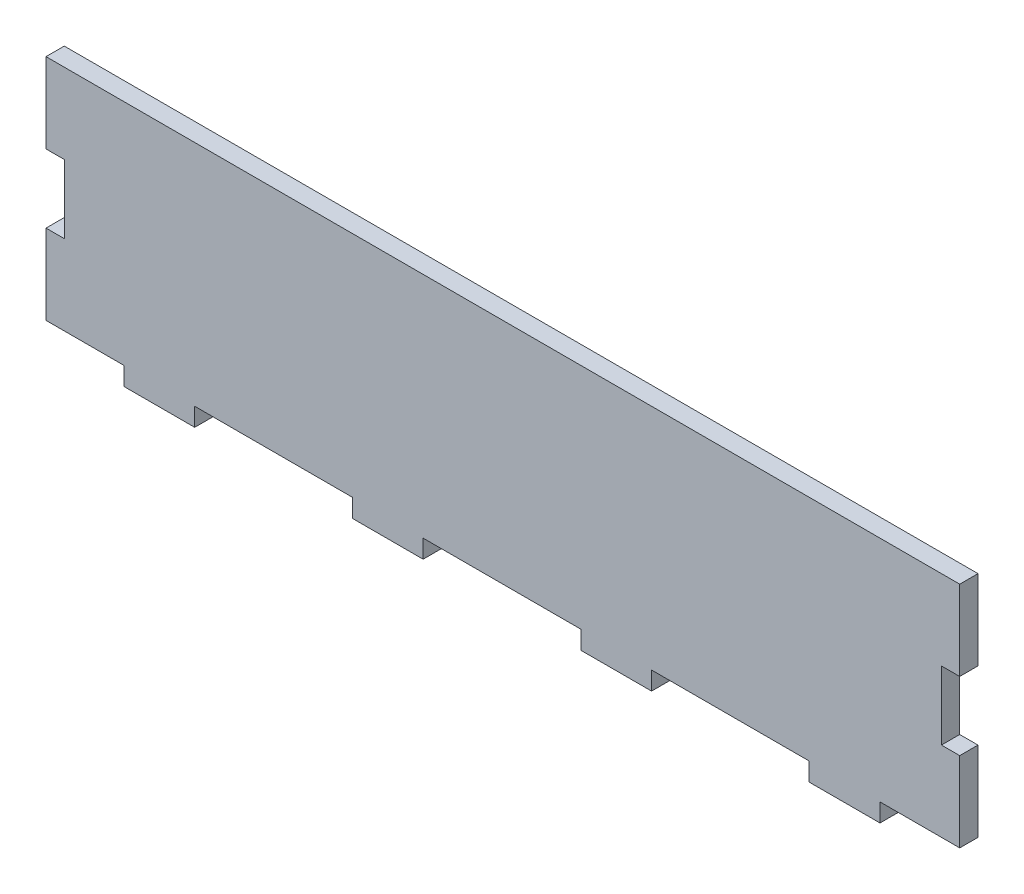
ISO-10303-21;
HEADER;
FILE_DESCRIPTION(('STEP AP214'),'2;1');
FILE_NAME('part.step','',(''),(''),'','','');
FILE_SCHEMA(('AUTOMOTIVE_DESIGN { 1 0 10303 214 1 1 1 1 }'));
ENDSEC;
DATA;
#1=APPLICATION_CONTEXT('core data for automotive mechanical design processes');
#2=APPLICATION_PROTOCOL_DEFINITION('international standard','automotive_design',2000,#1);
#3=PRODUCT_CONTEXT('',#1,'mechanical');
#4=PRODUCT('Part','Part','',(#3));
#5=PRODUCT_RELATED_PRODUCT_CATEGORY('part','',(#4));
#6=PRODUCT_DEFINITION_FORMATION('','',#4);
#7=PRODUCT_DEFINITION_CONTEXT('part definition',#1,'design');
#8=PRODUCT_DEFINITION('design','',#6,#7);
#9=PRODUCT_DEFINITION_SHAPE('','',#8);
#10=(LENGTH_UNIT() NAMED_UNIT(*) SI_UNIT(.MILLI.,.METRE.));
#11=(NAMED_UNIT(*) PLANE_ANGLE_UNIT() SI_UNIT($,.RADIAN.));
#12=(NAMED_UNIT(*) SI_UNIT($,.STERADIAN.) SOLID_ANGLE_UNIT());
#13=UNCERTAINTY_MEASURE_WITH_UNIT(LENGTH_MEASURE(1.E-05),#10,'distance_accuracy_value','');
#14=(GEOMETRIC_REPRESENTATION_CONTEXT(3) GLOBAL_UNCERTAINTY_ASSIGNED_CONTEXT((#13)) GLOBAL_UNIT_ASSIGNED_CONTEXT((#10,
#11,#12)) REPRESENTATION_CONTEXT('',''));
#15=CARTESIAN_POINT('',(0.,0.,0.));
#16=DIRECTION('',(0.,0.,1.));
#17=DIRECTION('',(1.,0.,0.));
#18=AXIS2_PLACEMENT_3D('',#15,#16,#17);
#19=CARTESIAN_POINT('',(0.,0.,4.));
#20=DIRECTION('',(1.,0.,0.));
#21=DIRECTION('',(0.,0.,-1.));
#22=AXIS2_PLACEMENT_3D('',#19,#20,#21);
#23=PLANE('',#22);
#24=DIRECTION('',(0.,-1.,0.));
#25=VECTOR('',#24,1.);
#26=CARTESIAN_POINT('',(0.,0.,0.));
#27=LINE('',#26,#25);
#28=CARTESIAN_POINT('',(0.,50.,0.));
#29=VERTEX_POINT('',#28);
#30=CARTESIAN_POINT('',(0.,32.5,0.));
#31=VERTEX_POINT('',#30);
#32=EDGE_CURVE('E236',#29,#31,#27,.T.);
#33=ORIENTED_EDGE('',*,*,#32,.T.);
#34=DIRECTION('',(0.,0.,1.));
#35=VECTOR('',#34,1.);
#36=CARTESIAN_POINT('',(0.,32.5,-0.00100000000000013));
#37=LINE('',#36,#35);
#38=CARTESIAN_POINT('',(0.,32.5,4.));
#39=VERTEX_POINT('',#38);
#40=EDGE_CURVE('E217',#31,#39,#37,.T.);
#41=ORIENTED_EDGE('',*,*,#40,.T.);
#42=DIRECTION('',(0.,-1.,0.));
#43=VECTOR('',#42,1.);
#44=CARTESIAN_POINT('',(0.,0.,4.));
#45=LINE('',#44,#43);
#46=CARTESIAN_POINT('',(0.,50.,4.));
#47=VERTEX_POINT('',#46);
#48=EDGE_CURVE('E414',#47,#39,#45,.T.);
#49=ORIENTED_EDGE('',*,*,#48,.F.);
#50=DIRECTION('',(0.,0.,-1.));
#51=VECTOR('',#50,1.);
#52=CARTESIAN_POINT('',(0.,50.,4.));
#53=LINE('',#52,#51);
#54=EDGE_CURVE('E243',#47,#29,#53,.T.);
#55=ORIENTED_EDGE('',*,*,#54,.T.);
#56=EDGE_LOOP('',(#33,#41,#49,#55));
#57=FACE_BOUND('',#56,.T.);
#58=ADVANCED_FACE('F33',(#57),#23,.F.);
#59=CARTESIAN_POINT('',(200.,0.,4.));
#60=DIRECTION('',(-1.,0.,0.));
#61=DIRECTION('',(0.,0.,1.));
#62=AXIS2_PLACEMENT_3D('',#59,#60,#61);
#63=PLANE('',#62);
#64=DIRECTION('',(0.,1.,0.));
#65=VECTOR('',#64,1.);
#66=CARTESIAN_POINT('',(200.,0.,4.));
#67=LINE('',#66,#65);
#68=CARTESIAN_POINT('',(200.,32.5,4.));
#69=VERTEX_POINT('',#68);
#70=CARTESIAN_POINT('',(200.,50.,4.));
#71=VERTEX_POINT('',#70);
#72=EDGE_CURVE('E419',#69,#71,#67,.T.);
#73=ORIENTED_EDGE('',*,*,#72,.F.);
#74=DIRECTION('',(0.,0.,1.));
#75=VECTOR('',#74,1.);
#76=CARTESIAN_POINT('',(200.,32.5,-0.00100000000000013));
#77=LINE('',#76,#75);
#78=CARTESIAN_POINT('',(200.,32.5,0.));
#79=VERTEX_POINT('',#78);
#80=EDGE_CURVE('E299',#79,#69,#77,.T.);
#81=ORIENTED_EDGE('',*,*,#80,.F.);
#82=DIRECTION('',(0.,1.,0.));
#83=VECTOR('',#82,1.);
#84=CARTESIAN_POINT('',(200.,0.,0.));
#85=LINE('',#84,#83);
#86=CARTESIAN_POINT('',(200.,50.,0.));
#87=VERTEX_POINT('',#86);
#88=EDGE_CURVE('E255',#79,#87,#85,.T.);
#89=ORIENTED_EDGE('',*,*,#88,.T.);
#90=DIRECTION('',(0.,0.,-1.));
#91=VECTOR('',#90,1.);
#92=CARTESIAN_POINT('',(200.,50.,4.));
#93=LINE('',#92,#91);
#94=EDGE_CURVE('E264',#71,#87,#93,.T.);
#95=ORIENTED_EDGE('',*,*,#94,.F.);
#96=EDGE_LOOP('',(#73,#81,#89,#95));
#97=FACE_BOUND('',#96,.T.);
#98=ADVANCED_FACE('F431',(#97),#63,.F.);
#99=CARTESIAN_POINT('',(0.,0.,4.));
#100=DIRECTION('',(0.,1.,0.));
#101=DIRECTION('',(0.,0.,1.));
#102=AXIS2_PLACEMENT_3D('',#99,#100,#101);
#103=PLANE('',#102);
#104=DIRECTION('',(0.,0.,1.));
#105=VECTOR('',#104,1.);
#106=CARTESIAN_POINT('',(32.55,0.,0.));
#107=LINE('',#106,#105);
#108=CARTESIAN_POINT('',(32.55,0.,0.));
#109=VERTEX_POINT('',#108);
#110=CARTESIAN_POINT('',(32.55,0.,4.));
#111=VERTEX_POINT('',#110);
#112=EDGE_CURVE('E315',#109,#111,#107,.T.);
#113=ORIENTED_EDGE('',*,*,#112,.F.);
#114=DIRECTION('',(1.,0.,0.));
#115=VECTOR('',#114,1.);
#116=CARTESIAN_POINT('',(0.,0.,0.));
#117=LINE('',#116,#115);
#118=CARTESIAN_POINT('',(67.05,0.,0.));
#119=VERTEX_POINT('',#118);
#120=EDGE_CURVE('E256',#109,#119,#117,.T.);
#121=ORIENTED_EDGE('',*,*,#120,.T.);
#122=DIRECTION('',(0.,0.,1.));
#123=VECTOR('',#122,1.);
#124=CARTESIAN_POINT('',(67.05,0.,0.));
#125=LINE('',#124,#123);
#126=CARTESIAN_POINT('',(67.05,0.,4.));
#127=VERTEX_POINT('',#126);
#128=EDGE_CURVE('E352',#119,#127,#125,.T.);
#129=ORIENTED_EDGE('',*,*,#128,.T.);
#130=DIRECTION('',(1.,0.,0.));
#131=VECTOR('',#130,1.);
#132=CARTESIAN_POINT('',(0.,0.,4.));
#133=LINE('',#132,#131);
#134=EDGE_CURVE('E420',#111,#127,#133,.T.);
#135=ORIENTED_EDGE('',*,*,#134,.F.);
#136=EDGE_LOOP('',(#113,#121,#129,#135));
#137=FACE_BOUND('',#136,.T.);
#138=ADVANCED_FACE('F474',(#137),#103,.F.);
#139=DIRECTION('',(0.,0.,1.));
#140=VECTOR('',#139,1.);
#141=CARTESIAN_POINT('',(17.05,0.,0.));
#142=LINE('',#141,#140);
#143=CARTESIAN_POINT('',(17.05,0.,0.));
#144=VERTEX_POINT('',#143);
#145=CARTESIAN_POINT('',(17.05,0.,4.));
#146=VERTEX_POINT('',#145);
#147=EDGE_CURVE('E325',#144,#146,#142,.T.);
#148=ORIENTED_EDGE('',*,*,#147,.T.);
#149=CARTESIAN_POINT('',(0.,0.,4.));
#150=VERTEX_POINT('',#149);
#151=EDGE_CURVE('E417',#150,#146,#133,.T.);
#152=ORIENTED_EDGE('',*,*,#151,.F.);
#153=DIRECTION('',(0.,0.,-1.));
#154=VECTOR('',#153,1.);
#155=CARTESIAN_POINT('',(0.,0.,4.));
#156=LINE('',#155,#154);
#157=CARTESIAN_POINT('',(0.,0.,0.));
#158=VERTEX_POINT('',#157);
#159=EDGE_CURVE('E11',#150,#158,#156,.T.);
#160=ORIENTED_EDGE('',*,*,#159,.T.);
#161=EDGE_CURVE('E249',#158,#144,#117,.T.);
#162=ORIENTED_EDGE('',*,*,#161,.T.);
#163=EDGE_LOOP('',(#148,#152,#160,#162));
#164=FACE_BOUND('',#163,.T.);
#165=ADVANCED_FACE('F457',(#164),#103,.F.);
#166=DIRECTION('',(0.,0.,1.));
#167=VECTOR('',#166,1.);
#168=CARTESIAN_POINT('',(82.55,0.,0.));
#169=LINE('',#168,#167);
#170=CARTESIAN_POINT('',(82.55,0.,0.));
#171=VERTEX_POINT('',#170);
#172=CARTESIAN_POINT('',(82.55,0.,4.));
#173=VERTEX_POINT('',#172);
#174=EDGE_CURVE('E343',#171,#173,#169,.T.);
#175=ORIENTED_EDGE('',*,*,#174,.F.);
#176=CARTESIAN_POINT('',(117.05,0.,0.));
#177=VERTEX_POINT('',#176);
#178=EDGE_CURVE('E499',#171,#177,#117,.T.);
#179=ORIENTED_EDGE('',*,*,#178,.T.);
#180=DIRECTION('',(0.,0.,1.));
#181=VECTOR('',#180,1.);
#182=CARTESIAN_POINT('',(117.05,0.,0.));
#183=LINE('',#182,#181);
#184=CARTESIAN_POINT('',(117.05,0.,4.));
#185=VERTEX_POINT('',#184);
#186=EDGE_CURVE('E380',#177,#185,#183,.T.);
#187=ORIENTED_EDGE('',*,*,#186,.T.);
#188=EDGE_CURVE('E476',#173,#185,#133,.T.);
#189=ORIENTED_EDGE('',*,*,#188,.F.);
#190=EDGE_LOOP('',(#175,#179,#187,#189));
#191=FACE_BOUND('',#190,.T.);
#192=ADVANCED_FACE('F502',(#191),#103,.F.);
#193=DIRECTION('',(0.,0.,1.));
#194=VECTOR('',#193,1.);
#195=CARTESIAN_POINT('',(132.55,0.,0.));
#196=LINE('',#195,#194);
#197=CARTESIAN_POINT('',(132.55,0.,0.));
#198=VERTEX_POINT('',#197);
#199=CARTESIAN_POINT('',(132.55,0.,4.));
#200=VERTEX_POINT('',#199);
#201=EDGE_CURVE('E371',#198,#200,#196,.T.);
#202=ORIENTED_EDGE('',*,*,#201,.F.);
#203=CARTESIAN_POINT('',(167.05,0.,0.));
#204=VERTEX_POINT('',#203);
#205=EDGE_CURVE('E247',#198,#204,#117,.T.);
#206=ORIENTED_EDGE('',*,*,#205,.T.);
#207=DIRECTION('',(0.,0.,1.));
#208=VECTOR('',#207,1.);
#209=CARTESIAN_POINT('',(167.05,0.,0.));
#210=LINE('',#209,#208);
#211=CARTESIAN_POINT('',(167.05,0.,4.));
#212=VERTEX_POINT('',#211);
#213=EDGE_CURVE('E406',#204,#212,#210,.T.);
#214=ORIENTED_EDGE('',*,*,#213,.T.);
#215=EDGE_CURVE('E477',#200,#212,#133,.T.);
#216=ORIENTED_EDGE('',*,*,#215,.F.);
#217=EDGE_LOOP('',(#202,#206,#214,#216));
#218=FACE_BOUND('',#217,.T.);
#219=ADVANCED_FACE('F497',(#218),#103,.F.);
#220=DIRECTION('',(0.,0.,1.));
#221=VECTOR('',#220,1.);
#222=CARTESIAN_POINT('',(182.55,0.,0.));
#223=LINE('',#222,#221);
#224=CARTESIAN_POINT('',(182.55,0.,0.));
#225=VERTEX_POINT('',#224);
#226=CARTESIAN_POINT('',(182.55,0.,4.));
#227=VERTEX_POINT('',#226);
#228=EDGE_CURVE('E398',#225,#227,#223,.T.);
#229=ORIENTED_EDGE('',*,*,#228,.F.);
#230=CARTESIAN_POINT('',(200.,0.,0.));
#231=VERTEX_POINT('',#230);
#232=EDGE_CURVE('E244',#225,#231,#117,.T.);
#233=ORIENTED_EDGE('',*,*,#232,.T.);
#234=DIRECTION('',(0.,0.,-1.));
#235=VECTOR('',#234,1.);
#236=CARTESIAN_POINT('',(200.,0.,4.));
#237=LINE('',#236,#235);
#238=CARTESIAN_POINT('',(200.,0.,4.));
#239=VERTEX_POINT('',#238);
#240=EDGE_CURVE('E41',#239,#231,#237,.T.);
#241=ORIENTED_EDGE('',*,*,#240,.F.);
#242=EDGE_CURVE('E416',#227,#239,#133,.T.);
#243=ORIENTED_EDGE('',*,*,#242,.F.);
#244=EDGE_LOOP('',(#229,#233,#241,#243));
#245=FACE_BOUND('',#244,.T.);
#246=ADVANCED_FACE('F484',(#245),#103,.F.);
#247=CARTESIAN_POINT('',(0.,17.5,4.));
#248=VERTEX_POINT('',#247);
#249=EDGE_CURVE('E262',#248,#150,#45,.T.);
#250=ORIENTED_EDGE('',*,*,#249,.F.);
#251=DIRECTION('',(0.,0.,1.));
#252=VECTOR('',#251,1.);
#253=CARTESIAN_POINT('',(0.,17.5,-0.00100000000000013));
#254=LINE('',#253,#252);
#255=CARTESIAN_POINT('',(0.,17.5,0.));
#256=VERTEX_POINT('',#255);
#257=EDGE_CURVE('E439',#256,#248,#254,.T.);
#258=ORIENTED_EDGE('',*,*,#257,.F.);
#259=EDGE_CURVE('E245',#256,#158,#27,.T.);
#260=ORIENTED_EDGE('',*,*,#259,.T.);
#261=ORIENTED_EDGE('',*,*,#159,.F.);
#262=EDGE_LOOP('',(#250,#258,#260,#261));
#263=FACE_BOUND('',#262,.T.);
#264=ADVANCED_FACE('F35',(#263),#23,.F.);
#265=CARTESIAN_POINT('',(200.,17.5,0.));
#266=VERTEX_POINT('',#265);
#267=EDGE_CURVE('E257',#231,#266,#85,.T.);
#268=ORIENTED_EDGE('',*,*,#267,.T.);
#269=DIRECTION('',(0.,0.,1.));
#270=VECTOR('',#269,1.);
#271=CARTESIAN_POINT('',(200.,17.5,-0.00100000000000013));
#272=LINE('',#271,#270);
#273=CARTESIAN_POINT('',(200.,17.5,4.));
#274=VERTEX_POINT('',#273);
#275=EDGE_CURVE('E301',#266,#274,#272,.T.);
#276=ORIENTED_EDGE('',*,*,#275,.T.);
#277=EDGE_CURVE('E274',#239,#274,#67,.T.);
#278=ORIENTED_EDGE('',*,*,#277,.F.);
#279=ORIENTED_EDGE('',*,*,#240,.T.);
#280=EDGE_LOOP('',(#268,#276,#278,#279));
#281=FACE_BOUND('',#280,.T.);
#282=ADVANCED_FACE('F271',(#281),#63,.F.);
#283=CARTESIAN_POINT('',(0.,50.,4.));
#284=DIRECTION('',(0.,-1.,0.));
#285=DIRECTION('',(0.,0.,-1.));
#286=AXIS2_PLACEMENT_3D('',#283,#284,#285);
#287=PLANE('',#286);
#288=DIRECTION('',(-1.,0.,0.));
#289=VECTOR('',#288,1.);
#290=CARTESIAN_POINT('',(0.,50.,0.));
#291=LINE('',#290,#289);
#292=EDGE_CURVE('E260',#87,#29,#291,.T.);
#293=ORIENTED_EDGE('',*,*,#292,.T.);
#294=ORIENTED_EDGE('',*,*,#54,.F.);
#295=DIRECTION('',(-1.,0.,0.));
#296=VECTOR('',#295,1.);
#297=CARTESIAN_POINT('',(0.,50.,4.));
#298=LINE('',#297,#296);
#299=EDGE_CURVE('E252',#71,#47,#298,.T.);
#300=ORIENTED_EDGE('',*,*,#299,.F.);
#301=ORIENTED_EDGE('',*,*,#94,.T.);
#302=EDGE_LOOP('',(#293,#294,#300,#301));
#303=FACE_BOUND('',#302,.T.);
#304=ADVANCED_FACE('F434',(#303),#287,.F.);
#305=CARTESIAN_POINT('',(0.,0.,4.));
#306=DIRECTION('',(0.,0.,-1.));
#307=DIRECTION('',(-1.,0.,0.));
#308=AXIS2_PLACEMENT_3D('',#305,#306,#307);
#309=PLANE('',#308);
#310=ORIENTED_EDGE('',*,*,#48,.T.);
#311=DIRECTION('',(-1.,0.,0.));
#312=VECTOR('',#311,1.);
#313=CARTESIAN_POINT('',(0.,32.5,4.));
#314=LINE('',#313,#312);
#315=CARTESIAN_POINT('',(4.,32.5,4.));
#316=VERTEX_POINT('',#315);
#317=EDGE_CURVE('E223',#316,#39,#314,.T.);
#318=ORIENTED_EDGE('',*,*,#317,.F.);
#319=DIRECTION('',(0.,1.,0.));
#320=VECTOR('',#319,1.);
#321=CARTESIAN_POINT('',(4.,32.5,4.));
#322=LINE('',#321,#320);
#323=CARTESIAN_POINT('',(4.,17.5,4.));
#324=VERTEX_POINT('',#323);
#325=EDGE_CURVE('E438',#324,#316,#322,.T.);
#326=ORIENTED_EDGE('',*,*,#325,.F.);
#327=DIRECTION('',(1.,0.,0.));
#328=VECTOR('',#327,1.);
#329=CARTESIAN_POINT('',(0.,17.5,4.));
#330=LINE('',#329,#328);
#331=EDGE_CURVE('E239',#248,#324,#330,.T.);
#332=ORIENTED_EDGE('',*,*,#331,.F.);
#333=ORIENTED_EDGE('',*,*,#249,.T.);
#334=ORIENTED_EDGE('',*,*,#151,.T.);
#335=DIRECTION('',(0.,1.,0.));
#336=VECTOR('',#335,1.);
#337=CARTESIAN_POINT('',(17.05,0.,4.));
#338=LINE('',#337,#336);
#339=CARTESIAN_POINT('',(17.05,-4.,4.));
#340=VERTEX_POINT('',#339);
#341=EDGE_CURVE('E310',#340,#146,#338,.T.);
#342=ORIENTED_EDGE('',*,*,#341,.F.);
#343=DIRECTION('',(-1.,0.,0.));
#344=VECTOR('',#343,1.);
#345=CARTESIAN_POINT('',(32.55,-4.,4.));
#346=LINE('',#345,#344);
#347=CARTESIAN_POINT('',(32.55,-4.,4.));
#348=VERTEX_POINT('',#347);
#349=EDGE_CURVE('E319',#348,#340,#346,.T.);
#350=ORIENTED_EDGE('',*,*,#349,.F.);
#351=DIRECTION('',(0.,-1.,0.));
#352=VECTOR('',#351,1.);
#353=CARTESIAN_POINT('',(32.55,0.,4.));
#354=LINE('',#353,#352);
#355=EDGE_CURVE('E316',#111,#348,#354,.T.);
#356=ORIENTED_EDGE('',*,*,#355,.F.);
#357=ORIENTED_EDGE('',*,*,#134,.T.);
#358=DIRECTION('',(0.,1.,0.));
#359=VECTOR('',#358,1.);
#360=CARTESIAN_POINT('',(67.05,0.,4.));
#361=LINE('',#360,#359);
#362=CARTESIAN_POINT('',(67.05,-4.,4.));
#363=VERTEX_POINT('',#362);
#364=EDGE_CURVE('E338',#363,#127,#361,.T.);
#365=ORIENTED_EDGE('',*,*,#364,.F.);
#366=DIRECTION('',(-1.,0.,0.));
#367=VECTOR('',#366,1.);
#368=CARTESIAN_POINT('',(82.55,-4.,4.));
#369=LINE('',#368,#367);
#370=CARTESIAN_POINT('',(82.55,-4.,4.));
#371=VERTEX_POINT('',#370);
#372=EDGE_CURVE('E346',#371,#363,#369,.T.);
#373=ORIENTED_EDGE('',*,*,#372,.F.);
#374=DIRECTION('',(0.,-1.,0.));
#375=VECTOR('',#374,1.);
#376=CARTESIAN_POINT('',(82.55,0.,4.));
#377=LINE('',#376,#375);
#378=EDGE_CURVE('E333',#173,#371,#377,.T.);
#379=ORIENTED_EDGE('',*,*,#378,.F.);
#380=ORIENTED_EDGE('',*,*,#188,.T.);
#381=DIRECTION('',(0.,1.,0.));
#382=VECTOR('',#381,1.);
#383=CARTESIAN_POINT('',(117.05,0.,4.));
#384=LINE('',#383,#382);
#385=CARTESIAN_POINT('',(117.05,-4.,4.));
#386=VERTEX_POINT('',#385);
#387=EDGE_CURVE('E366',#386,#185,#384,.T.);
#388=ORIENTED_EDGE('',*,*,#387,.F.);
#389=DIRECTION('',(-1.,0.,0.));
#390=VECTOR('',#389,1.);
#391=CARTESIAN_POINT('',(132.55,-4.,4.));
#392=LINE('',#391,#390);
#393=CARTESIAN_POINT('',(132.55,-4.,4.));
#394=VERTEX_POINT('',#393);
#395=EDGE_CURVE('E374',#394,#386,#392,.T.);
#396=ORIENTED_EDGE('',*,*,#395,.F.);
#397=DIRECTION('',(0.,-1.,0.));
#398=VECTOR('',#397,1.);
#399=CARTESIAN_POINT('',(132.55,0.,4.));
#400=LINE('',#399,#398);
#401=EDGE_CURVE('E361',#200,#394,#400,.T.);
#402=ORIENTED_EDGE('',*,*,#401,.F.);
#403=ORIENTED_EDGE('',*,*,#215,.T.);
#404=DIRECTION('',(0.,1.,0.));
#405=VECTOR('',#404,1.);
#406=CARTESIAN_POINT('',(167.05,0.,4.));
#407=LINE('',#406,#405);
#408=CARTESIAN_POINT('',(167.05,-4.,4.));
#409=VERTEX_POINT('',#408);
#410=EDGE_CURVE('E393',#409,#212,#407,.T.);
#411=ORIENTED_EDGE('',*,*,#410,.F.);
#412=DIRECTION('',(-1.,0.,0.));
#413=VECTOR('',#412,1.);
#414=CARTESIAN_POINT('',(182.55,-4.,4.));
#415=LINE('',#414,#413);
#416=CARTESIAN_POINT('',(182.55,-4.,4.));
#417=VERTEX_POINT('',#416);
#418=EDGE_CURVE('E401',#417,#409,#415,.T.);
#419=ORIENTED_EDGE('',*,*,#418,.F.);
#420=DIRECTION('',(0.,-1.,0.));
#421=VECTOR('',#420,1.);
#422=CARTESIAN_POINT('',(182.55,0.,4.));
#423=LINE('',#422,#421);
#424=EDGE_CURVE('E389',#227,#417,#423,.T.);
#425=ORIENTED_EDGE('',*,*,#424,.F.);
#426=ORIENTED_EDGE('',*,*,#242,.T.);
#427=ORIENTED_EDGE('',*,*,#277,.T.);
#428=DIRECTION('',(1.,0.,0.));
#429=VECTOR('',#428,1.);
#430=CARTESIAN_POINT('',(200.,17.5,4.));
#431=LINE('',#430,#429);
#432=CARTESIAN_POINT('',(196.,17.5,4.));
#433=VERTEX_POINT('',#432);
#434=EDGE_CURVE('E296',#433,#274,#431,.T.);
#435=ORIENTED_EDGE('',*,*,#434,.F.);
#436=DIRECTION('',(0.,-1.,0.));
#437=VECTOR('',#436,1.);
#438=CARTESIAN_POINT('',(196.,32.5,4.));
#439=LINE('',#438,#437);
#440=CARTESIAN_POINT('',(196.,32.5,4.));
#441=VERTEX_POINT('',#440);
#442=EDGE_CURVE('E294',#441,#433,#439,.T.);
#443=ORIENTED_EDGE('',*,*,#442,.F.);
#444=DIRECTION('',(-1.,0.,0.));
#445=VECTOR('',#444,1.);
#446=CARTESIAN_POINT('',(200.,32.5,4.));
#447=LINE('',#446,#445);
#448=EDGE_CURVE('E287',#69,#441,#447,.T.);
#449=ORIENTED_EDGE('',*,*,#448,.F.);
#450=ORIENTED_EDGE('',*,*,#72,.T.);
#451=ORIENTED_EDGE('',*,*,#299,.T.);
#452=EDGE_LOOP('',(#310,#318,#326,#332,#333,#334,#342,#350,#356,#357,#365,#373,#379,#380,#388,
#396,#402,#403,#411,#419,#425,#426,#427,#435,#443,#449,#450,#451));
#453=FACE_BOUND('',#452,.T.);
#454=ADVANCED_FACE('F426',(#453),#309,.F.);
#455=CARTESIAN_POINT('',(0.,0.,0.));
#456=DIRECTION('',(0.,0.,-1.));
#457=DIRECTION('',(-1.,0.,0.));
#458=AXIS2_PLACEMENT_3D('',#455,#456,#457);
#459=PLANE('',#458);
#460=DIRECTION('',(-1.,0.,0.));
#461=VECTOR('',#460,1.);
#462=CARTESIAN_POINT('',(0.,32.5,0.));
#463=LINE('',#462,#461);
#464=CARTESIAN_POINT('',(4.,32.5,0.));
#465=VERTEX_POINT('',#464);
#466=EDGE_CURVE('E220',#465,#31,#463,.T.);
#467=ORIENTED_EDGE('',*,*,#466,.T.);
#468=ORIENTED_EDGE('',*,*,#32,.F.);
#469=ORIENTED_EDGE('',*,*,#292,.F.);
#470=ORIENTED_EDGE('',*,*,#88,.F.);
#471=DIRECTION('',(-1.,0.,0.));
#472=VECTOR('',#471,1.);
#473=CARTESIAN_POINT('',(200.,32.5,0.));
#474=LINE('',#473,#472);
#475=CARTESIAN_POINT('',(196.,32.5,0.));
#476=VERTEX_POINT('',#475);
#477=EDGE_CURVE('E285',#79,#476,#474,.T.);
#478=ORIENTED_EDGE('',*,*,#477,.T.);
#479=DIRECTION('',(0.,-1.,0.));
#480=VECTOR('',#479,1.);
#481=CARTESIAN_POINT('',(196.,32.5,0.));
#482=LINE('',#481,#480);
#483=CARTESIAN_POINT('',(196.,17.5,0.));
#484=VERTEX_POINT('',#483);
#485=EDGE_CURVE('E283',#476,#484,#482,.T.);
#486=ORIENTED_EDGE('',*,*,#485,.T.);
#487=DIRECTION('',(1.,0.,0.));
#488=VECTOR('',#487,1.);
#489=CARTESIAN_POINT('',(200.,17.5,0.));
#490=LINE('',#489,#488);
#491=EDGE_CURVE('E281',#484,#266,#490,.T.);
#492=ORIENTED_EDGE('',*,*,#491,.T.);
#493=ORIENTED_EDGE('',*,*,#267,.F.);
#494=ORIENTED_EDGE('',*,*,#232,.F.);
#495=DIRECTION('',(0.,-1.,0.));
#496=VECTOR('',#495,1.);
#497=CARTESIAN_POINT('',(182.55,0.,0.));
#498=LINE('',#497,#496);
#499=CARTESIAN_POINT('',(182.55,-4.,0.));
#500=VERTEX_POINT('',#499);
#501=EDGE_CURVE('E390',#225,#500,#498,.T.);
#502=ORIENTED_EDGE('',*,*,#501,.T.);
#503=DIRECTION('',(-1.,0.,0.));
#504=VECTOR('',#503,1.);
#505=CARTESIAN_POINT('',(182.55,-4.,0.));
#506=LINE('',#505,#504);
#507=CARTESIAN_POINT('',(167.05,-4.,0.));
#508=VERTEX_POINT('',#507);
#509=EDGE_CURVE('E392',#500,#508,#506,.T.);
#510=ORIENTED_EDGE('',*,*,#509,.T.);
#511=DIRECTION('',(0.,1.,0.));
#512=VECTOR('',#511,1.);
#513=CARTESIAN_POINT('',(167.05,0.,0.));
#514=LINE('',#513,#512);
#515=EDGE_CURVE('E395',#508,#204,#514,.T.);
#516=ORIENTED_EDGE('',*,*,#515,.T.);
#517=ORIENTED_EDGE('',*,*,#205,.F.);
#518=DIRECTION('',(0.,-1.,0.));
#519=VECTOR('',#518,1.);
#520=CARTESIAN_POINT('',(132.55,0.,0.));
#521=LINE('',#520,#519);
#522=CARTESIAN_POINT('',(132.55,-4.,0.));
#523=VERTEX_POINT('',#522);
#524=EDGE_CURVE('E362',#198,#523,#521,.T.);
#525=ORIENTED_EDGE('',*,*,#524,.T.);
#526=DIRECTION('',(-1.,0.,0.));
#527=VECTOR('',#526,1.);
#528=CARTESIAN_POINT('',(132.55,-4.,0.));
#529=LINE('',#528,#527);
#530=CARTESIAN_POINT('',(117.05,-4.,0.));
#531=VERTEX_POINT('',#530);
#532=EDGE_CURVE('E365',#523,#531,#529,.T.);
#533=ORIENTED_EDGE('',*,*,#532,.T.);
#534=DIRECTION('',(0.,1.,0.));
#535=VECTOR('',#534,1.);
#536=CARTESIAN_POINT('',(117.05,0.,0.));
#537=LINE('',#536,#535);
#538=EDGE_CURVE('E368',#531,#177,#537,.T.);
#539=ORIENTED_EDGE('',*,*,#538,.T.);
#540=ORIENTED_EDGE('',*,*,#178,.F.);
#541=DIRECTION('',(0.,-1.,0.));
#542=VECTOR('',#541,1.);
#543=CARTESIAN_POINT('',(82.55,0.,0.));
#544=LINE('',#543,#542);
#545=CARTESIAN_POINT('',(82.55,-4.,0.));
#546=VERTEX_POINT('',#545);
#547=EDGE_CURVE('E334',#171,#546,#544,.T.);
#548=ORIENTED_EDGE('',*,*,#547,.T.);
#549=DIRECTION('',(-1.,0.,0.));
#550=VECTOR('',#549,1.);
#551=CARTESIAN_POINT('',(82.55,-4.,0.));
#552=LINE('',#551,#550);
#553=CARTESIAN_POINT('',(67.05,-4.,0.));
#554=VERTEX_POINT('',#553);
#555=EDGE_CURVE('E337',#546,#554,#552,.T.);
#556=ORIENTED_EDGE('',*,*,#555,.T.);
#557=DIRECTION('',(0.,1.,0.));
#558=VECTOR('',#557,1.);
#559=CARTESIAN_POINT('',(67.05,0.,0.));
#560=LINE('',#559,#558);
#561=EDGE_CURVE('E340',#554,#119,#560,.T.);
#562=ORIENTED_EDGE('',*,*,#561,.T.);
#563=ORIENTED_EDGE('',*,*,#120,.F.);
#564=DIRECTION('',(0.,-1.,0.));
#565=VECTOR('',#564,1.);
#566=CARTESIAN_POINT('',(32.55,0.,0.));
#567=LINE('',#566,#565);
#568=CARTESIAN_POINT('',(32.55,-4.,0.));
#569=VERTEX_POINT('',#568);
#570=EDGE_CURVE('E306',#109,#569,#567,.T.);
#571=ORIENTED_EDGE('',*,*,#570,.T.);
#572=DIRECTION('',(-1.,0.,0.));
#573=VECTOR('',#572,1.);
#574=CARTESIAN_POINT('',(32.55,-4.,0.));
#575=LINE('',#574,#573);
#576=CARTESIAN_POINT('',(17.05,-4.,0.));
#577=VERTEX_POINT('',#576);
#578=EDGE_CURVE('E309',#569,#577,#575,.T.);
#579=ORIENTED_EDGE('',*,*,#578,.T.);
#580=DIRECTION('',(0.,1.,0.));
#581=VECTOR('',#580,1.);
#582=CARTESIAN_POINT('',(17.05,0.,0.));
#583=LINE('',#582,#581);
#584=EDGE_CURVE('E312',#577,#144,#583,.T.);
#585=ORIENTED_EDGE('',*,*,#584,.T.);
#586=ORIENTED_EDGE('',*,*,#161,.F.);
#587=ORIENTED_EDGE('',*,*,#259,.F.);
#588=DIRECTION('',(1.,0.,0.));
#589=VECTOR('',#588,1.);
#590=CARTESIAN_POINT('',(0.,17.5,0.));
#591=LINE('',#590,#589);
#592=CARTESIAN_POINT('',(4.,17.5,0.));
#593=VERTEX_POINT('',#592);
#594=EDGE_CURVE('E228',#256,#593,#591,.T.);
#595=ORIENTED_EDGE('',*,*,#594,.T.);
#596=DIRECTION('',(0.,1.,0.));
#597=VECTOR('',#596,1.);
#598=CARTESIAN_POINT('',(4.,32.5,0.));
#599=LINE('',#598,#597);
#600=EDGE_CURVE('E238',#593,#465,#599,.T.);
#601=ORIENTED_EDGE('',*,*,#600,.T.);
#602=EDGE_LOOP('',(#467,#468,#469,#470,#478,#486,#492,#493,#494,#502,#510,#516,#517,#525,#533,
#539,#540,#548,#556,#562,#563,#571,#579,#585,#586,#587,#595,#601));
#603=FACE_BOUND('',#602,.T.);
#604=ADVANCED_FACE('F234',(#603),#459,.T.);
#605=CARTESIAN_POINT('',(182.55,0.,0.));
#606=DIRECTION('',(-1.,0.,0.));
#607=DIRECTION('',(0.,0.,1.));
#608=AXIS2_PLACEMENT_3D('',#605,#606,#607);
#609=PLANE('',#608);
#610=ORIENTED_EDGE('',*,*,#424,.T.);
#611=DIRECTION('',(0.,0.,1.));
#612=VECTOR('',#611,1.);
#613=CARTESIAN_POINT('',(182.55,-4.,0.));
#614=LINE('',#613,#612);
#615=EDGE_CURVE('E250',#500,#417,#614,.T.);
#616=ORIENTED_EDGE('',*,*,#615,.F.);
#617=ORIENTED_EDGE('',*,*,#501,.F.);
#618=ORIENTED_EDGE('',*,*,#228,.T.);
#619=EDGE_LOOP('',(#610,#616,#617,#618));
#620=FACE_BOUND('',#619,.T.);
#621=ADVANCED_FACE('F486',(#620),#609,.F.);
#622=CARTESIAN_POINT('',(182.55,-4.,0.));
#623=DIRECTION('',(0.,1.,0.));
#624=DIRECTION('',(0.,0.,1.));
#625=AXIS2_PLACEMENT_3D('',#622,#623,#624);
#626=PLANE('',#625);
#627=ORIENTED_EDGE('',*,*,#418,.T.);
#628=DIRECTION('',(0.,0.,1.));
#629=VECTOR('',#628,1.);
#630=CARTESIAN_POINT('',(167.05,-4.,0.));
#631=LINE('',#630,#629);
#632=EDGE_CURVE('E409',#508,#409,#631,.T.);
#633=ORIENTED_EDGE('',*,*,#632,.F.);
#634=ORIENTED_EDGE('',*,*,#509,.F.);
#635=ORIENTED_EDGE('',*,*,#615,.T.);
#636=EDGE_LOOP('',(#627,#633,#634,#635));
#637=FACE_BOUND('',#636,.T.);
#638=ADVANCED_FACE('F492',(#637),#626,.F.);
#639=CARTESIAN_POINT('',(167.05,0.,0.));
#640=DIRECTION('',(1.,0.,0.));
#641=DIRECTION('',(0.,0.,-1.));
#642=AXIS2_PLACEMENT_3D('',#639,#640,#641);
#643=PLANE('',#642);
#644=ORIENTED_EDGE('',*,*,#410,.T.);
#645=ORIENTED_EDGE('',*,*,#213,.F.);
#646=ORIENTED_EDGE('',*,*,#515,.F.);
#647=ORIENTED_EDGE('',*,*,#632,.T.);
#648=EDGE_LOOP('',(#644,#645,#646,#647));
#649=FACE_BOUND('',#648,.T.);
#650=ADVANCED_FACE('F494',(#649),#643,.F.);
#651=CARTESIAN_POINT('',(132.55,0.,0.));
#652=DIRECTION('',(-1.,0.,0.));
#653=DIRECTION('',(0.,0.,1.));
#654=AXIS2_PLACEMENT_3D('',#651,#652,#653);
#655=PLANE('',#654);
#656=ORIENTED_EDGE('',*,*,#401,.T.);
#657=DIRECTION('',(0.,0.,1.));
#658=VECTOR('',#657,1.);
#659=CARTESIAN_POINT('',(132.55,-4.,0.));
#660=LINE('',#659,#658);
#661=EDGE_CURVE('E386',#523,#394,#660,.T.);
#662=ORIENTED_EDGE('',*,*,#661,.F.);
#663=ORIENTED_EDGE('',*,*,#524,.F.);
#664=ORIENTED_EDGE('',*,*,#201,.T.);
#665=EDGE_LOOP('',(#656,#662,#663,#664));
#666=FACE_BOUND('',#665,.T.);
#667=ADVANCED_FACE('F513',(#666),#655,.F.);
#668=CARTESIAN_POINT('',(132.55,-4.,0.));
#669=DIRECTION('',(0.,1.,0.));
#670=DIRECTION('',(0.,0.,1.));
#671=AXIS2_PLACEMENT_3D('',#668,#669,#670);
#672=PLANE('',#671);
#673=ORIENTED_EDGE('',*,*,#395,.T.);
#674=DIRECTION('',(0.,0.,1.));
#675=VECTOR('',#674,1.);
#676=CARTESIAN_POINT('',(117.05,-4.,0.));
#677=LINE('',#676,#675);
#678=EDGE_CURVE('E383',#531,#386,#677,.T.);
#679=ORIENTED_EDGE('',*,*,#678,.F.);
#680=ORIENTED_EDGE('',*,*,#532,.F.);
#681=ORIENTED_EDGE('',*,*,#661,.T.);
#682=EDGE_LOOP('',(#673,#679,#680,#681));
#683=FACE_BOUND('',#682,.T.);
#684=ADVANCED_FACE('F511',(#683),#672,.F.);
#685=CARTESIAN_POINT('',(117.05,0.,0.));
#686=DIRECTION('',(1.,0.,0.));
#687=DIRECTION('',(0.,0.,-1.));
#688=AXIS2_PLACEMENT_3D('',#685,#686,#687);
#689=PLANE('',#688);
#690=ORIENTED_EDGE('',*,*,#387,.T.);
#691=ORIENTED_EDGE('',*,*,#186,.F.);
#692=ORIENTED_EDGE('',*,*,#538,.F.);
#693=ORIENTED_EDGE('',*,*,#678,.T.);
#694=EDGE_LOOP('',(#690,#691,#692,#693));
#695=FACE_BOUND('',#694,.T.);
#696=ADVANCED_FACE('F508',(#695),#689,.F.);
#697=CARTESIAN_POINT('',(82.55,0.,0.));
#698=DIRECTION('',(-1.,0.,0.));
#699=DIRECTION('',(0.,0.,1.));
#700=AXIS2_PLACEMENT_3D('',#697,#698,#699);
#701=PLANE('',#700);
#702=ORIENTED_EDGE('',*,*,#378,.T.);
#703=DIRECTION('',(0.,0.,1.));
#704=VECTOR('',#703,1.);
#705=CARTESIAN_POINT('',(82.55,-4.,0.));
#706=LINE('',#705,#704);
#707=EDGE_CURVE('E358',#546,#371,#706,.T.);
#708=ORIENTED_EDGE('',*,*,#707,.F.);
#709=ORIENTED_EDGE('',*,*,#547,.F.);
#710=ORIENTED_EDGE('',*,*,#174,.T.);
#711=EDGE_LOOP('',(#702,#708,#709,#710));
#712=FACE_BOUND('',#711,.T.);
#713=ADVANCED_FACE('F656',(#712),#701,.F.);
#714=CARTESIAN_POINT('',(82.55,-4.,0.));
#715=DIRECTION('',(0.,1.,0.));
#716=DIRECTION('',(0.,0.,1.));
#717=AXIS2_PLACEMENT_3D('',#714,#715,#716);
#718=PLANE('',#717);
#719=ORIENTED_EDGE('',*,*,#372,.T.);
#720=DIRECTION('',(0.,0.,1.));
#721=VECTOR('',#720,1.);
#722=CARTESIAN_POINT('',(67.05,-4.,0.));
#723=LINE('',#722,#721);
#724=EDGE_CURVE('E355',#554,#363,#723,.T.);
#725=ORIENTED_EDGE('',*,*,#724,.F.);
#726=ORIENTED_EDGE('',*,*,#555,.F.);
#727=ORIENTED_EDGE('',*,*,#707,.T.);
#728=EDGE_LOOP('',(#719,#725,#726,#727));
#729=FACE_BOUND('',#728,.T.);
#730=ADVANCED_FACE('F652',(#729),#718,.F.);
#731=CARTESIAN_POINT('',(67.05,0.,0.));
#732=DIRECTION('',(1.,0.,0.));
#733=DIRECTION('',(0.,0.,-1.));
#734=AXIS2_PLACEMENT_3D('',#731,#732,#733);
#735=PLANE('',#734);
#736=ORIENTED_EDGE('',*,*,#364,.T.);
#737=ORIENTED_EDGE('',*,*,#128,.F.);
#738=ORIENTED_EDGE('',*,*,#561,.F.);
#739=ORIENTED_EDGE('',*,*,#724,.T.);
#740=EDGE_LOOP('',(#736,#737,#738,#739));
#741=FACE_BOUND('',#740,.T.);
#742=ADVANCED_FACE('F649',(#741),#735,.F.);
#743=CARTESIAN_POINT('',(32.55,0.,0.));
#744=DIRECTION('',(-1.,0.,0.));
#745=DIRECTION('',(0.,0.,1.));
#746=AXIS2_PLACEMENT_3D('',#743,#744,#745);
#747=PLANE('',#746);
#748=ORIENTED_EDGE('',*,*,#355,.T.);
#749=DIRECTION('',(0.,0.,1.));
#750=VECTOR('',#749,1.);
#751=CARTESIAN_POINT('',(32.55,-4.,0.));
#752=LINE('',#751,#750);
#753=EDGE_CURVE('E330',#569,#348,#752,.T.);
#754=ORIENTED_EDGE('',*,*,#753,.F.);
#755=ORIENTED_EDGE('',*,*,#570,.F.);
#756=ORIENTED_EDGE('',*,*,#112,.T.);
#757=EDGE_LOOP('',(#748,#754,#755,#756));
#758=FACE_BOUND('',#757,.T.);
#759=ADVANCED_FACE('F470',(#758),#747,.F.);
#760=CARTESIAN_POINT('',(32.55,-4.,0.));
#761=DIRECTION('',(0.,1.,0.));
#762=DIRECTION('',(0.,0.,1.));
#763=AXIS2_PLACEMENT_3D('',#760,#761,#762);
#764=PLANE('',#763);
#765=ORIENTED_EDGE('',*,*,#349,.T.);
#766=DIRECTION('',(0.,0.,1.));
#767=VECTOR('',#766,1.);
#768=CARTESIAN_POINT('',(17.05,-4.,0.));
#769=LINE('',#768,#767);
#770=EDGE_CURVE('E327',#577,#340,#769,.T.);
#771=ORIENTED_EDGE('',*,*,#770,.F.);
#772=ORIENTED_EDGE('',*,*,#578,.F.);
#773=ORIENTED_EDGE('',*,*,#753,.T.);
#774=EDGE_LOOP('',(#765,#771,#772,#773));
#775=FACE_BOUND('',#774,.T.);
#776=ADVANCED_FACE('F465',(#775),#764,.F.);
#777=CARTESIAN_POINT('',(17.05,0.,0.));
#778=DIRECTION('',(1.,0.,0.));
#779=DIRECTION('',(0.,0.,-1.));
#780=AXIS2_PLACEMENT_3D('',#777,#778,#779);
#781=PLANE('',#780);
#782=ORIENTED_EDGE('',*,*,#341,.T.);
#783=ORIENTED_EDGE('',*,*,#147,.F.);
#784=ORIENTED_EDGE('',*,*,#584,.F.);
#785=ORIENTED_EDGE('',*,*,#770,.T.);
#786=EDGE_LOOP('',(#782,#783,#784,#785));
#787=FACE_BOUND('',#786,.T.);
#788=ADVANCED_FACE('F461',(#787),#781,.F.);
#789=CARTESIAN_POINT('',(200.,32.5,-0.00100000000000013));
#790=DIRECTION('',(0.,1.,0.));
#791=DIRECTION('',(-1.,0.,0.));
#792=AXIS2_PLACEMENT_3D('',#789,#790,#791);
#793=PLANE('',#792);
#794=ORIENTED_EDGE('',*,*,#80,.T.);
#795=ORIENTED_EDGE('',*,*,#448,.T.);
#796=DIRECTION('',(0.,0.,1.));
#797=VECTOR('',#796,1.);
#798=CARTESIAN_POINT('',(196.,32.5,-0.00100000000000013));
#799=LINE('',#798,#797);
#800=EDGE_CURVE('E298',#476,#441,#799,.T.);
#801=ORIENTED_EDGE('',*,*,#800,.F.);
#802=ORIENTED_EDGE('',*,*,#477,.F.);
#803=EDGE_LOOP('',(#794,#795,#801,#802));
#804=FACE_BOUND('',#803,.T.);
#805=ADVANCED_FACE('F591',(#804),#793,.F.);
#806=CARTESIAN_POINT('',(200.,17.5,-0.00100000000000013));
#807=DIRECTION('',(0.,-1.,0.));
#808=DIRECTION('',(0.,0.,-1.));
#809=AXIS2_PLACEMENT_3D('',#806,#807,#808);
#810=PLANE('',#809);
#811=DIRECTION('',(0.,0.,1.));
#812=VECTOR('',#811,1.);
#813=CARTESIAN_POINT('',(196.,17.5,-0.00100000000000013));
#814=LINE('',#813,#812);
#815=EDGE_CURVE('E56',#484,#433,#814,.T.);
#816=ORIENTED_EDGE('',*,*,#815,.T.);
#817=ORIENTED_EDGE('',*,*,#434,.T.);
#818=ORIENTED_EDGE('',*,*,#275,.F.);
#819=ORIENTED_EDGE('',*,*,#491,.F.);
#820=EDGE_LOOP('',(#816,#817,#818,#819));
#821=FACE_BOUND('',#820,.T.);
#822=ADVANCED_FACE('F596',(#821),#810,.F.);
#823=CARTESIAN_POINT('',(196.,32.5,-0.00100000000000013));
#824=DIRECTION('',(-1.,0.,0.));
#825=DIRECTION('',(0.,0.,1.));
#826=AXIS2_PLACEMENT_3D('',#823,#824,#825);
#827=PLANE('',#826);
#828=ORIENTED_EDGE('',*,*,#800,.T.);
#829=ORIENTED_EDGE('',*,*,#442,.T.);
#830=ORIENTED_EDGE('',*,*,#815,.F.);
#831=ORIENTED_EDGE('',*,*,#485,.F.);
#832=EDGE_LOOP('',(#828,#829,#830,#831));
#833=FACE_BOUND('',#832,.T.);
#834=ADVANCED_FACE('F607',(#833),#827,.F.);
#835=CARTESIAN_POINT('',(0.,32.5,-0.00100000000000013));
#836=DIRECTION('',(0.,1.,0.));
#837=DIRECTION('',(-1.,0.,0.));
#838=AXIS2_PLACEMENT_3D('',#835,#836,#837);
#839=PLANE('',#838);
#840=DIRECTION('',(0.,0.,1.));
#841=VECTOR('',#840,1.);
#842=CARTESIAN_POINT('',(4.,32.5,-0.00100000000000013));
#843=LINE('',#842,#841);
#844=EDGE_CURVE('E229',#465,#316,#843,.T.);
#845=ORIENTED_EDGE('',*,*,#844,.T.);
#846=ORIENTED_EDGE('',*,*,#317,.T.);
#847=ORIENTED_EDGE('',*,*,#40,.F.);
#848=ORIENTED_EDGE('',*,*,#466,.F.);
#849=EDGE_LOOP('',(#845,#846,#847,#848));
#850=FACE_BOUND('',#849,.T.);
#851=ADVANCED_FACE('F219',(#850),#839,.F.);
#852=CARTESIAN_POINT('',(4.,32.5,-0.00100000000000013));
#853=DIRECTION('',(1.,0.,0.));
#854=DIRECTION('',(0.,1.,0.));
#855=AXIS2_PLACEMENT_3D('',#852,#853,#854);
#856=PLANE('',#855);
#857=DIRECTION('',(0.,0.,1.));
#858=VECTOR('',#857,1.);
#859=CARTESIAN_POINT('',(4.,17.5,-0.00100000000000013));
#860=LINE('',#859,#858);
#861=EDGE_CURVE('E48',#593,#324,#860,.T.);
#862=ORIENTED_EDGE('',*,*,#861,.T.);
#863=ORIENTED_EDGE('',*,*,#325,.T.);
#864=ORIENTED_EDGE('',*,*,#844,.F.);
#865=ORIENTED_EDGE('',*,*,#600,.F.);
#866=EDGE_LOOP('',(#862,#863,#864,#865));
#867=FACE_BOUND('',#866,.T.);
#868=ADVANCED_FACE('F446',(#867),#856,.F.);
#869=CARTESIAN_POINT('',(0.,17.5,-0.00100000000000013));
#870=DIRECTION('',(0.,-1.,0.));
#871=DIRECTION('',(0.,0.,-1.));
#872=AXIS2_PLACEMENT_3D('',#869,#870,#871);
#873=PLANE('',#872);
#874=ORIENTED_EDGE('',*,*,#257,.T.);
#875=ORIENTED_EDGE('',*,*,#331,.T.);
#876=ORIENTED_EDGE('',*,*,#861,.F.);
#877=ORIENTED_EDGE('',*,*,#594,.F.);
#878=EDGE_LOOP('',(#874,#875,#876,#877));
#879=FACE_BOUND('',#878,.T.);
#880=ADVANCED_FACE('F447',(#879),#873,.F.);
#881=CLOSED_SHELL('',(#58,#98,#138,#165,#192,#219,#246,#264,#282,#304,#454,#604,#621,#638,#650,
#667,#684,#696,#713,#730,#742,#759,#776,#788,#805,#822,#834,#851,#868,#880));
#882=MANIFOLD_SOLID_BREP('B2',#881);
#883=ADVANCED_BREP_SHAPE_REPRESENTATION('',(#18,#882),#14);
#884=SHAPE_DEFINITION_REPRESENTATION(#9,#883);
ENDSEC;
END-ISO-10303-21;
